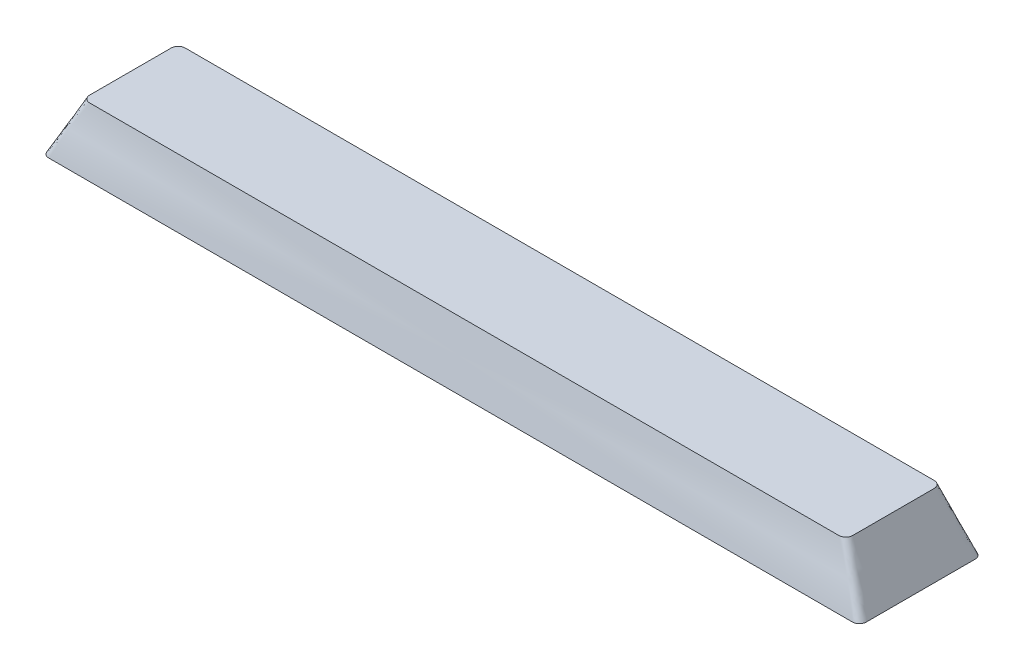
ISO-10303-21;
HEADER;
FILE_DESCRIPTION(('STEP AP214'),'2;1');
FILE_NAME('part.step','',(''),(''),'','','');
FILE_SCHEMA(('AUTOMOTIVE_DESIGN { 1 0 10303 214 1 1 1 1 }'));
ENDSEC;
DATA;
#1=APPLICATION_CONTEXT('core data for automotive mechanical design processes');
#2=APPLICATION_PROTOCOL_DEFINITION('international standard','automotive_design',2000,#1);
#3=PRODUCT_CONTEXT('',#1,'mechanical');
#4=PRODUCT('Part','Part','',(#3));
#5=PRODUCT_RELATED_PRODUCT_CATEGORY('part','',(#4));
#6=PRODUCT_DEFINITION_FORMATION('','',#4);
#7=PRODUCT_DEFINITION_CONTEXT('part definition',#1,'design');
#8=PRODUCT_DEFINITION('design','',#6,#7);
#9=PRODUCT_DEFINITION_SHAPE('','',#8);
#10=(LENGTH_UNIT() NAMED_UNIT(*) SI_UNIT(.MILLI.,.METRE.));
#11=(NAMED_UNIT(*) PLANE_ANGLE_UNIT() SI_UNIT($,.RADIAN.));
#12=(NAMED_UNIT(*) SI_UNIT($,.STERADIAN.) SOLID_ANGLE_UNIT());
#13=UNCERTAINTY_MEASURE_WITH_UNIT(LENGTH_MEASURE(1.E-05),#10,'distance_accuracy_value','');
#14=(GEOMETRIC_REPRESENTATION_CONTEXT(3) GLOBAL_UNCERTAINTY_ASSIGNED_CONTEXT((#13)) GLOBAL_UNIT_ASSIGNED_CONTEXT((#10,
#11,#12)) REPRESENTATION_CONTEXT('',''));
#15=CARTESIAN_POINT('',(0.,0.,0.));
#16=DIRECTION('',(0.,0.,1.));
#17=DIRECTION('',(1.,0.,0.));
#18=AXIS2_PLACEMENT_3D('',#15,#16,#17);
#19=CARTESIAN_POINT('',(-58.9788,0.,-7.9883));
#20=DIRECTION('',(0.,-1.,0.));
#21=DIRECTION('',(0.,0.,-1.));
#22=AXIS2_PLACEMENT_3D('',#19,#20,#21);
#23=PLANE('',#22);
#24=CARTESIAN_POINT('',(-58.9788,0.,-7.9883));
#25=DIRECTION('',(0.,1.,0.));
#26=DIRECTION('',(0.,0.,-1.));
#27=AXIS2_PLACEMENT_3D('',#24,#25,#26);
#28=CIRCLE('',#27,1.016);
#29=CARTESIAN_POINT('',(-58.9787999999118,0.,-9.00430000000001));
#30=VERTEX_POINT('',#29);
#31=CARTESIAN_POINT('',(-59.9948,0.,-7.9883));
#32=VERTEX_POINT('',#31);
#33=EDGE_CURVE('E320',#30,#32,#28,.T.);
#34=ORIENTED_EDGE('',*,*,#33,.F.);
#35=DIRECTION('',(-1.,0.,0.));
#36=VECTOR('',#35,1.);
#37=CARTESIAN_POINT('',(-58.9788,0.,-9.0043));
#38=LINE('',#37,#36);
#39=CARTESIAN_POINT('',(58.9787999999929,0.,-9.00430000000001));
#40=VERTEX_POINT('',#39);
#41=EDGE_CURVE('E568',#40,#30,#38,.T.);
#42=ORIENTED_EDGE('',*,*,#41,.F.);
#43=CARTESIAN_POINT('',(58.9788,0.,-7.9883));
#44=DIRECTION('',(0.,1.,0.));
#45=DIRECTION('',(0.,0.,-1.));
#46=AXIS2_PLACEMENT_3D('',#43,#44,#45);
#47=CIRCLE('',#46,1.016);
#48=CARTESIAN_POINT('',(59.9948,0.,-7.98830000001442));
#49=VERTEX_POINT('',#48);
#50=EDGE_CURVE('E558',#49,#40,#47,.T.);
#51=ORIENTED_EDGE('',*,*,#50,.F.);
#52=DIRECTION('',(0.,0.,-1.));
#53=VECTOR('',#52,1.);
#54=CARTESIAN_POINT('',(59.9948,0.,7.9883));
#55=LINE('',#54,#53);
#56=CARTESIAN_POINT('',(59.9948,0.,7.98830000120263));
#57=VERTEX_POINT('',#56);
#58=EDGE_CURVE('E548',#57,#49,#55,.T.);
#59=ORIENTED_EDGE('',*,*,#58,.F.);
#60=CARTESIAN_POINT('',(58.9788,0.,7.9883));
#61=DIRECTION('',(0.,1.,0.));
#62=DIRECTION('',(0.,0.,1.));
#63=AXIS2_PLACEMENT_3D('',#60,#61,#62);
#64=CIRCLE('',#63,1.016);
#65=CARTESIAN_POINT('',(58.9787999999117,0.,9.0043));
#66=VERTEX_POINT('',#65);
#67=EDGE_CURVE('E538',#66,#57,#64,.T.);
#68=ORIENTED_EDGE('',*,*,#67,.F.);
#69=DIRECTION('',(1.,0.,0.));
#70=VECTOR('',#69,1.);
#71=CARTESIAN_POINT('',(-58.9788,0.,9.0043));
#72=LINE('',#71,#70);
#73=CARTESIAN_POINT('',(-58.9787999999929,0.,9.00430000000001));
#74=VERTEX_POINT('',#73);
#75=EDGE_CURVE('E531',#74,#66,#72,.T.);
#76=ORIENTED_EDGE('',*,*,#75,.F.);
#77=CARTESIAN_POINT('',(-58.9788,0.,7.9883));
#78=DIRECTION('',(0.,1.,0.));
#79=DIRECTION('',(0.,0.,-1.));
#80=AXIS2_PLACEMENT_3D('',#77,#78,#79);
#81=CIRCLE('',#80,1.016);
#82=CARTESIAN_POINT('',(-59.9948,0.,7.9883));
#83=VERTEX_POINT('',#82);
#84=EDGE_CURVE('E252',#83,#74,#81,.T.);
#85=ORIENTED_EDGE('',*,*,#84,.F.);
#86=DIRECTION('',(0.,0.,1.));
#87=VECTOR('',#86,1.);
#88=CARTESIAN_POINT('',(-59.9948,0.,7.9883));
#89=LINE('',#88,#87);
#90=EDGE_CURVE('E13',#32,#83,#89,.T.);
#91=ORIENTED_EDGE('',*,*,#90,.F.);
#92=EDGE_LOOP('',(#34,#42,#51,#59,#68,#76,#85,#91));
#93=FACE_BOUND('',#92,.T.);
#94=ADVANCED_FACE('F241',(#93),#23,.T.);
#95=CARTESIAN_POINT('',(54.9783,8.001,-5.9817));
#96=DIRECTION('',(0.,-1.,0.));
#97=DIRECTION('',(0.,0.,-1.));
#98=AXIS2_PLACEMENT_3D('',#95,#96,#97);
#99=PLANE('',#98);
#100=CARTESIAN_POINT('',(54.9783,8.001,-5.9817));
#101=DIRECTION('',(0.,1.,0.));
#102=DIRECTION('',(0.,0.,-1.));
#103=AXIS2_PLACEMENT_3D('',#100,#101,#102);
#104=CIRCLE('',#103,1.016);
#105=CARTESIAN_POINT('',(55.9943,8.001,-5.9817));
#106=VERTEX_POINT('',#105);
#107=CARTESIAN_POINT('',(54.9783,8.001,-6.9977));
#108=VERTEX_POINT('',#107);
#109=EDGE_CURVE('E315',#106,#108,#104,.T.);
#110=ORIENTED_EDGE('',*,*,#109,.T.);
#111=DIRECTION('',(-1.,0.,0.));
#112=VECTOR('',#111,1.);
#113=CARTESIAN_POINT('',(-54.9783,8.001,-6.9977));
#114=LINE('',#113,#112);
#115=CARTESIAN_POINT('',(-54.9783,8.001,-6.9977));
#116=VERTEX_POINT('',#115);
#117=EDGE_CURVE('E307',#108,#116,#114,.T.);
#118=ORIENTED_EDGE('',*,*,#117,.T.);
#119=CARTESIAN_POINT('',(-54.9783,8.001,-5.9817));
#120=DIRECTION('',(0.,1.,0.));
#121=DIRECTION('',(0.,0.,-1.));
#122=AXIS2_PLACEMENT_3D('',#119,#120,#121);
#123=CIRCLE('',#122,1.016);
#124=CARTESIAN_POINT('',(-55.9943,8.001,-5.9817));
#125=VERTEX_POINT('',#124);
#126=EDGE_CURVE('E311',#116,#125,#123,.T.);
#127=ORIENTED_EDGE('',*,*,#126,.T.);
#128=DIRECTION('',(0.,0.,1.));
#129=VECTOR('',#128,1.);
#130=CARTESIAN_POINT('',(-55.9943,8.001,5.9817));
#131=LINE('',#130,#129);
#132=CARTESIAN_POINT('',(-55.9943,8.001,5.9817));
#133=VERTEX_POINT('',#132);
#134=EDGE_CURVE('E327',#125,#133,#131,.T.);
#135=ORIENTED_EDGE('',*,*,#134,.T.);
#136=CARTESIAN_POINT('',(-54.9783,8.001,5.9817));
#137=DIRECTION('',(0.,1.,0.));
#138=DIRECTION('',(0.,0.,-1.));
#139=AXIS2_PLACEMENT_3D('',#136,#137,#138);
#140=CIRCLE('',#139,1.016);
#141=CARTESIAN_POINT('',(-54.9783,8.001,6.9977));
#142=VERTEX_POINT('',#141);
#143=EDGE_CURVE('E467',#133,#142,#140,.T.);
#144=ORIENTED_EDGE('',*,*,#143,.T.);
#145=DIRECTION('',(1.,0.,0.));
#146=VECTOR('',#145,1.);
#147=CARTESIAN_POINT('',(-54.9783,8.001,6.9977));
#148=LINE('',#147,#146);
#149=CARTESIAN_POINT('',(54.9783,8.001,6.9977));
#150=VERTEX_POINT('',#149);
#151=EDGE_CURVE('E478',#142,#150,#148,.T.);
#152=ORIENTED_EDGE('',*,*,#151,.T.);
#153=CARTESIAN_POINT('',(54.9783,8.001,5.9817));
#154=DIRECTION('',(0.,1.,0.));
#155=DIRECTION('',(0.,0.,1.));
#156=AXIS2_PLACEMENT_3D('',#153,#154,#155);
#157=CIRCLE('',#156,1.016);
#158=CARTESIAN_POINT('',(55.9943,8.001,5.9817));
#159=VERTEX_POINT('',#158);
#160=EDGE_CURVE('E481',#150,#159,#157,.T.);
#161=ORIENTED_EDGE('',*,*,#160,.T.);
#162=DIRECTION('',(0.,0.,-1.));
#163=VECTOR('',#162,1.);
#164=CARTESIAN_POINT('',(55.9943,8.001,5.9817));
#165=LINE('',#164,#163);
#166=EDGE_CURVE('E499',#159,#106,#165,.T.);
#167=ORIENTED_EDGE('',*,*,#166,.T.);
#168=EDGE_LOOP('',(#110,#118,#127,#135,#144,#152,#161,#167));
#169=FACE_BOUND('',#168,.T.);
#170=ADVANCED_FACE('F310',(#169),#99,.F.);
#171=CARTESIAN_POINT('',(-54.9782999991749,8.001,-6.9977));
#172=CARTESIAN_POINT('',(-58.9787999991157,0.,-9.00430000000001));
#173=CARTESIAN_POINT('',(-45.8108496456775,8.001,-6.9977));
#174=CARTESIAN_POINT('',(-49.1538229100873,0.,-9.0043));
#175=CARTESIAN_POINT('',(-27.4825541569986,8.001,-6.9977));
#176=CARTESIAN_POINT('',(-29.4966396205792,0.,-9.00430000000001));
#177=CARTESIAN_POINT('',(0.,8.001,-6.9977));
#178=CARTESIAN_POINT('',(0.,0.,-9.00429999999999));
#179=CARTESIAN_POINT('',(27.4825541569986,8.001,-6.9977));
#180=CARTESIAN_POINT('',(29.4966396205791,0.,-9.00430000000001));
#181=CARTESIAN_POINT('',(45.8108496456775,8.001,-6.9977));
#182=CARTESIAN_POINT('',(49.1538229100873,0.,-9.0043));
#183=CARTESIAN_POINT('',(55.1068937338428,8.001,-6.9977));
#184=CARTESIAN_POINT('',(59.1166169981925,0.,-9.00430000000001));
#185=CARTESIAN_POINT('',(55.3779955225431,8.001,-6.94764326754296));
#186=CARTESIAN_POINT('',(59.3780377282811,0.,-8.94896090382494));
#187=CARTESIAN_POINT('',(55.7357540483972,8.001,-6.70281995541021));
#188=CARTESIAN_POINT('',(59.7016681627244,0.,-8.73619224540106));
#189=CARTESIAN_POINT('',(55.9538311201303,8.001,-6.34656374701974));
#190=CARTESIAN_POINT('',(59.9293911884094,0.,-8.41484562663684));
#191=CARTESIAN_POINT('',(55.9943,8.001,-6.09823811462995));
#192=CARTESIAN_POINT('',(59.9948,0.,-8.13933029040698));
#193=CARTESIAN_POINT('',(55.9943,8.001,-4.96829402638625));
#194=CARTESIAN_POINT('',(59.9948,0.,-6.67495286905437));
#195=CARTESIAN_POINT('',(55.9942999999999,8.001,-2.96675881189001));
#196=CARTESIAN_POINT('',(59.9947999999999,0.,-4.02175444264689));
#197=CARTESIAN_POINT('',(55.9943,8.001,0.));
#198=CARTESIAN_POINT('',(59.9948000000002,0.,0.));
#199=CARTESIAN_POINT('',(55.9943,8.001,2.96675881189001));
#200=CARTESIAN_POINT('',(59.9947999999999,0.,4.0217544426469));
#201=CARTESIAN_POINT('',(55.9943,8.001,4.96829402638625));
#202=CARTESIAN_POINT('',(59.9948,0.,6.67495286905438));
#203=CARTESIAN_POINT('',(55.9943,8.001,6.09823811462995));
#204=CARTESIAN_POINT('',(59.9948,0.,8.13933029040699));
#205=CARTESIAN_POINT('',(55.9538311201302,8.001,6.34656374701973));
#206=CARTESIAN_POINT('',(59.9293911884093,0.,8.41484562663685));
#207=CARTESIAN_POINT('',(55.7357540483973,8.001,6.70281995541022));
#208=CARTESIAN_POINT('',(59.7016681627246,0.,8.73619224540107));
#209=CARTESIAN_POINT('',(55.3779955225431,8.001,6.94764326754295));
#210=CARTESIAN_POINT('',(59.378037728281,0.,8.94896090382492));
#211=CARTESIAN_POINT('',(55.1068937338428,8.001,6.9977));
#212=CARTESIAN_POINT('',(59.1166169981925,0.,9.0043));
#213=CARTESIAN_POINT('',(45.8108496456775,8.001,6.9977));
#214=CARTESIAN_POINT('',(49.1538229100873,0.,9.0043));
#215=CARTESIAN_POINT('',(27.4825541569986,8.001,6.9977));
#216=CARTESIAN_POINT('',(29.4966396205792,0.,9.0043));
#217=CARTESIAN_POINT('',(0.,8.001,6.9977));
#218=CARTESIAN_POINT('',(0.,0.,9.00429999999999));
#219=CARTESIAN_POINT('',(-27.4825541569986,8.00099999999999,6.9977));
#220=CARTESIAN_POINT('',(-29.4966396205792,0.,9.00430000000001));
#221=CARTESIAN_POINT('',(-45.8108496456775,8.001,6.9977));
#222=CARTESIAN_POINT('',(-49.1538229100873,0.,9.0043));
#223=CARTESIAN_POINT('',(-55.1068937338428,8.001,6.9977));
#224=CARTESIAN_POINT('',(-59.1166169981925,0.,9.00430000000001));
#225=CARTESIAN_POINT('',(-55.3779955225431,8.001,6.94764326754297));
#226=CARTESIAN_POINT('',(-59.3780377282809,0.,8.94896090382492));
#227=CARTESIAN_POINT('',(-55.7357540483972,8.001,6.70281995541019));
#228=CARTESIAN_POINT('',(-59.7016681627246,0.,8.73619224540109));
#229=CARTESIAN_POINT('',(-55.9538311201303,8.001,6.34656374701977));
#230=CARTESIAN_POINT('',(-59.9293911884093,0.,8.41484562663683));
#231=CARTESIAN_POINT('',(-55.9943,8.001,6.09823811462995));
#232=CARTESIAN_POINT('',(-59.9948,0.,8.13933029040698));
#233=CARTESIAN_POINT('',(-55.9943,8.001,4.96829402638625));
#234=CARTESIAN_POINT('',(-59.9948,0.,6.67495286905437));
#235=CARTESIAN_POINT('',(-55.9942999999999,8.00099999999999,2.96675881189002));
#236=CARTESIAN_POINT('',(-59.9947999999999,0.,4.02175444264688));
#237=CARTESIAN_POINT('',(-55.9943000000001,8.00100000000001,0.));
#238=CARTESIAN_POINT('',(-59.9948000000002,0.,0.));
#239=CARTESIAN_POINT('',(-55.9943,8.00099999999999,-2.96675881189001));
#240=CARTESIAN_POINT('',(-59.9947999999999,0.,-4.02175444264693));
#241=CARTESIAN_POINT('',(-55.9943,8.001,-4.96829402638625));
#242=CARTESIAN_POINT('',(-59.9948,0.,-6.67495286905438));
#243=CARTESIAN_POINT('',(-55.9943,8.001,-6.09823811462995));
#244=CARTESIAN_POINT('',(-59.9948,0.,-8.13933029040698));
#245=CARTESIAN_POINT('',(-55.9538311201302,8.001,-6.34656374701975));
#246=CARTESIAN_POINT('',(-59.9293911884093,0.,-8.41484562663683));
#247=CARTESIAN_POINT('',(-55.7357540483973,8.001,-6.70281995541021));
#248=CARTESIAN_POINT('',(-59.7016681627246,0.,-8.73619224540108));
#249=CARTESIAN_POINT('',(-55.377995522543,8.00099999999999,-6.94764326754296));
#250=CARTESIAN_POINT('',(-59.378037728281,0.,-8.94896090382494));
#251=CARTESIAN_POINT('',(-55.1068937338428,8.001,-6.9977));
#252=CARTESIAN_POINT('',(-59.1166169981925,0.,-9.00430000000001));
#253=CARTESIAN_POINT('',(-54.9782999991749,8.001,-6.9977));
#254=CARTESIAN_POINT('',(-58.9787999991157,0.,-9.00430000000001));
#255=B_SPLINE_SURFACE_WITH_KNOTS('',3,1,((#171,#172),(#173,#174),(#175,#176),(#177,#178),(#179,
#180),(#181,#182),(#183,#184),(#185,#186),(#187,#188),(#189,#190),(#191,#192),(#193,#194),(#195,
#196),(#197,#198),(#199,#200),(#201,#202),(#203,#204),(#205,#206),(#207,#208),(#209,#210),(#211,
#212),(#213,#214),(#215,#216),(#217,#218),(#219,#220),(#221,#222),(#223,#224),(#225,#226),(#227,
#228),(#229,#230),(#231,#232),(#233,#234),(#235,#236),(#237,#238),(#239,#240),(#241,#242),(#243,
#244),(#245,#246),(#247,#248),(#249,#250),(#251,#252),(#253,#254)),.UNSPECIFIED.,.T.,.F.,.F.,(4,
1,1,1,2,1,1,1,2,1,1,1,2,1,1,1,2,1,1,1,2,1,1,1,2,1,1,1,2,1,1,1,4),(2,2),(0.,0.108692450190497,
0.217384900380994,0.326077350571491,0.434769800761988,0.436294452389348,0.437819104016708,
0.439343755644069,0.440868407271429,0.454126653826211,0.467384900380994,0.480643146935777,
0.493901393490559,0.495426045117919,0.49695069674528,0.49847534837264,0.5,0.608692450190497,
0.717384900380994,0.826077350571491,0.934769800761988,0.936294452389348,0.937819104016708,
0.939343755644069,0.940868407271429,0.954126653826211,0.967384900380994,0.980643146935777,
0.993901393490559,0.99542604511792,0.99695069674528,0.99847534837264,1.),(0.,1.),.UNSPECIFIED.);
#256=ORIENTED_EDGE('',*,*,#109,.F.);
#257=ORIENTED_EDGE('',*,*,#166,.F.);
#258=ORIENTED_EDGE('',*,*,#160,.F.);
#259=ORIENTED_EDGE('',*,*,#151,.F.);
#260=ORIENTED_EDGE('',*,*,#143,.F.);
#261=ORIENTED_EDGE('',*,*,#134,.F.);
#262=ORIENTED_EDGE('',*,*,#126,.F.);
#263=ORIENTED_EDGE('',*,*,#117,.F.);
#264=EDGE_LOOP('',(#256,#257,#258,#259,#260,#261,#262,#263));
#265=FACE_BOUND('',#264,.T.);
#266=ORIENTED_EDGE('',*,*,#90,.T.);
#267=ORIENTED_EDGE('',*,*,#84,.T.);
#268=ORIENTED_EDGE('',*,*,#75,.T.);
#269=ORIENTED_EDGE('',*,*,#67,.T.);
#270=ORIENTED_EDGE('',*,*,#58,.T.);
#271=ORIENTED_EDGE('',*,*,#50,.T.);
#272=ORIENTED_EDGE('',*,*,#41,.T.);
#273=ORIENTED_EDGE('',*,*,#33,.T.);
#274=EDGE_LOOP('',(#266,#267,#268,#269,#270,#271,#272,#273));
#275=FACE_BOUND('',#274,.T.);
#276=ADVANCED_FACE('F325',(#265,#275),#255,.T.);
#277=CLOSED_SHELL('',(#94,#170,#276));
#278=MANIFOLD_SOLID_BREP('B2',#277);
#279=ADVANCED_BREP_SHAPE_REPRESENTATION('',(#18,#278),#14);
#280=SHAPE_DEFINITION_REPRESENTATION(#9,#279);
ENDSEC;
END-ISO-10303-21;
